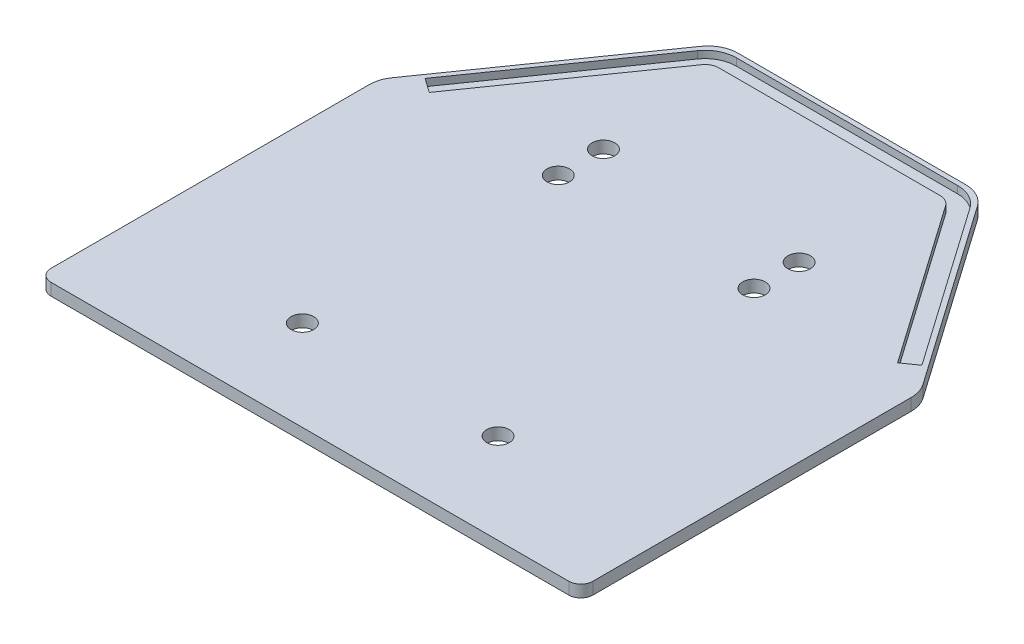
ISO-10303-21;
HEADER;
FILE_DESCRIPTION(('STEP AP214'),'2;1');
FILE_NAME('part.step','',(''),(''),'','','');
FILE_SCHEMA(('AUTOMOTIVE_DESIGN { 1 0 10303 214 1 1 1 1 }'));
ENDSEC;
DATA;
#1=APPLICATION_CONTEXT('core data for automotive mechanical design processes');
#2=APPLICATION_PROTOCOL_DEFINITION('international standard','automotive_design',2000,#1);
#3=PRODUCT_CONTEXT('',#1,'mechanical');
#4=PRODUCT('Part','Part','',(#3));
#5=PRODUCT_RELATED_PRODUCT_CATEGORY('part','',(#4));
#6=PRODUCT_DEFINITION_FORMATION('','',#4);
#7=PRODUCT_DEFINITION_CONTEXT('part definition',#1,'design');
#8=PRODUCT_DEFINITION('design','',#6,#7);
#9=PRODUCT_DEFINITION_SHAPE('','',#8);
#10=(LENGTH_UNIT() NAMED_UNIT(*) SI_UNIT(.MILLI.,.METRE.));
#11=(NAMED_UNIT(*) PLANE_ANGLE_UNIT() SI_UNIT($,.RADIAN.));
#12=(NAMED_UNIT(*) SI_UNIT($,.STERADIAN.) SOLID_ANGLE_UNIT());
#13=UNCERTAINTY_MEASURE_WITH_UNIT(LENGTH_MEASURE(1.E-05),#10,'distance_accuracy_value','');
#14=(GEOMETRIC_REPRESENTATION_CONTEXT(3) GLOBAL_UNCERTAINTY_ASSIGNED_CONTEXT((#13)) GLOBAL_UNIT_ASSIGNED_CONTEXT((#10,
#11,#12)) REPRESENTATION_CONTEXT('',''));
#15=CARTESIAN_POINT('',(0.,0.,0.));
#16=DIRECTION('',(0.,0.,1.));
#17=DIRECTION('',(1.,0.,0.));
#18=AXIS2_PLACEMENT_3D('',#15,#16,#17);
#19=CARTESIAN_POINT('',(0.,2.54,0.));
#20=DIRECTION('',(0.,-1.,0.));
#21=DIRECTION('',(0.,0.,-1.));
#22=AXIS2_PLACEMENT_3D('',#19,#20,#21);
#23=PLANE('',#22);
#24=CARTESIAN_POINT('',(-54.61,2.54,48.26));
#25=DIRECTION('',(0.,-1.,0.));
#26=DIRECTION('',(0.,0.,-1.));
#27=AXIS2_PLACEMENT_3D('',#24,#25,#26);
#28=CIRCLE('',#27,2.54);
#29=CARTESIAN_POINT('',(-57.15,2.54,48.26));
#30=VERTEX_POINT('',#29);
#31=CARTESIAN_POINT('',(-54.61,2.54,50.8));
#32=VERTEX_POINT('',#31);
#33=EDGE_CURVE('E336',#30,#32,#28,.F.);
#34=ORIENTED_EDGE('',*,*,#33,.T.);
#35=DIRECTION('',(1.,0.,0.));
#36=VECTOR('',#35,1.);
#37=CARTESIAN_POINT('',(-57.15,2.54,50.8));
#38=LINE('',#37,#36);
#39=CARTESIAN_POINT('',(54.61,2.54,50.8));
#40=VERTEX_POINT('',#39);
#41=EDGE_CURVE('E320',#32,#40,#38,.T.);
#42=ORIENTED_EDGE('',*,*,#41,.T.);
#43=CARTESIAN_POINT('',(54.61,2.54,48.26));
#44=DIRECTION('',(0.,-1.,0.));
#45=DIRECTION('',(0.,0.,-1.));
#46=AXIS2_PLACEMENT_3D('',#43,#44,#45);
#47=CIRCLE('',#46,2.54);
#48=CARTESIAN_POINT('',(57.15,2.54,48.26));
#49=VERTEX_POINT('',#48);
#50=EDGE_CURVE('E339',#40,#49,#47,.F.);
#51=ORIENTED_EDGE('',*,*,#50,.T.);
#52=DIRECTION('',(0.,0.,-1.));
#53=VECTOR('',#52,1.);
#54=CARTESIAN_POINT('',(57.15,2.54,50.8));
#55=LINE('',#54,#53);
#56=CARTESIAN_POINT('',(57.15,2.54,-18.8747754294001));
#57=VERTEX_POINT('',#56);
#58=EDGE_CURVE('E314',#49,#57,#55,.T.);
#59=ORIENTED_EDGE('',*,*,#58,.T.);
#60=CARTESIAN_POINT('',(50.8,2.54,-18.8747754294001));
#61=DIRECTION('',(0.,-1.,0.));
#62=DIRECTION('',(0.,0.,-1.));
#63=AXIS2_PLACEMENT_3D('',#60,#61,#62);
#64=CIRCLE('',#63,6.35);
#65=CARTESIAN_POINT('',(56.0016154812351,2.54,-22.5169858002293));
#66=VERTEX_POINT('',#65);
#67=EDGE_CURVE('E354',#57,#66,#64,.F.);
#68=ORIENTED_EDGE('',*,*,#67,.T.);
#69=DIRECTION('',(0.573576436351047,0.,0.819152044288991));
#70=VECTOR('',#69,1.);
#71=CARTESIAN_POINT('',(48.1571707167063,2.54,-33.7200139546897));
#72=LINE('',#71,#70);
#73=CARTESIAN_POINT('',(29.2010147102315,2.54,-60.7922103708292));
#74=VERTEX_POINT('',#73);
#75=EDGE_CURVE('E292',#74,#66,#72,.T.);
#76=ORIENTED_EDGE('',*,*,#75,.F.);
#77=CARTESIAN_POINT('',(23.9993992289964,2.54,-57.15));
#78=DIRECTION('',(0.,-1.,0.));
#79=DIRECTION('',(0.,0.,-1.));
#80=AXIS2_PLACEMENT_3D('',#77,#78,#79);
#81=CIRCLE('',#80,6.35);
#82=CARTESIAN_POINT('',(23.9993992289964,2.54,-63.5));
#83=VERTEX_POINT('',#82);
#84=EDGE_CURVE('E356',#74,#83,#81,.F.);
#85=ORIENTED_EDGE('',*,*,#84,.T.);
#86=DIRECTION('',(-1.,0.,0.));
#87=VECTOR('',#86,1.);
#88=CARTESIAN_POINT('',(0.,2.54,-63.5));
#89=LINE('',#88,#87);
#90=CARTESIAN_POINT('',(-23.9993992289964,2.54,-63.5));
#91=VERTEX_POINT('',#90);
#92=EDGE_CURVE('E279',#83,#91,#89,.T.);
#93=ORIENTED_EDGE('',*,*,#92,.T.);
#94=CARTESIAN_POINT('',(-23.9993992289964,2.54,-57.15));
#95=DIRECTION('',(0.,-1.,0.));
#96=DIRECTION('',(0.,0.,-1.));
#97=AXIS2_PLACEMENT_3D('',#94,#95,#96);
#98=CIRCLE('',#97,6.35);
#99=CARTESIAN_POINT('',(-29.2010147102315,2.54,-60.7922103708292));
#100=VERTEX_POINT('',#99);
#101=EDGE_CURVE('E358',#91,#100,#98,.F.);
#102=ORIENTED_EDGE('',*,*,#101,.T.);
#103=DIRECTION('',(-0.573576436351047,0.,0.819152044288992));
#104=VECTOR('',#103,1.);
#105=CARTESIAN_POINT('',(-48.1571707167063,2.54,-33.7200139546897));
#106=LINE('',#105,#104);
#107=CARTESIAN_POINT('',(-56.0016154812351,2.54,-22.5169858002292));
#108=VERTEX_POINT('',#107);
#109=EDGE_CURVE('E287',#100,#108,#106,.T.);
#110=ORIENTED_EDGE('',*,*,#109,.T.);
#111=CARTESIAN_POINT('',(-50.8,2.54,-18.8747754294001));
#112=DIRECTION('',(0.,-1.,0.));
#113=DIRECTION('',(0.,0.,-1.));
#114=AXIS2_PLACEMENT_3D('',#111,#112,#113);
#115=CIRCLE('',#114,6.35);
#116=CARTESIAN_POINT('',(-57.15,2.54,-18.8747754294001));
#117=VERTEX_POINT('',#116);
#118=EDGE_CURVE('E360',#108,#117,#115,.F.);
#119=ORIENTED_EDGE('',*,*,#118,.T.);
#120=DIRECTION('',(0.,0.,1.));
#121=VECTOR('',#120,1.);
#122=CARTESIAN_POINT('',(-57.15,2.54,50.8));
#123=LINE('',#122,#121);
#124=EDGE_CURVE('E317',#117,#30,#123,.T.);
#125=ORIENTED_EDGE('',*,*,#124,.T.);
#126=EDGE_LOOP('',(#34,#42,#51,#59,#68,#76,#85,#93,#102,#110,#119,#125));
#127=FACE_BOUND('',#126,.T.);
#128=DIRECTION('',(-1.,0.,0.));
#129=VECTOR('',#128,1.);
#130=CARTESIAN_POINT('',(23.3382790747957,2.54,-62.484));
#131=LINE('',#130,#129);
#132=CARTESIAN_POINT('',(23.3382790747957,2.54,-62.484));
#133=VERTEX_POINT('',#132);
#134=CARTESIAN_POINT('',(-23.3382790747956,2.54,-62.484));
#135=VERTEX_POINT('',#134);
#136=EDGE_CURVE('E588',#133,#135,#131,.T.);
#137=ORIENTED_EDGE('',*,*,#136,.F.);
#138=CARTESIAN_POINT('',(23.3382790747957,2.54,-55.88));
#139=DIRECTION('',(0.,1.,0.));
#140=DIRECTION('',(0.,0.,1.));
#141=AXIS2_PLACEMENT_3D('',#138,#139,#140);
#142=CIRCLE('',#141,6.604);
#143=CARTESIAN_POINT('',(28.7479591752803,2.54,-59.6678987856623));
#144=VERTEX_POINT('',#143);
#145=EDGE_CURVE('E214',#144,#133,#142,.T.);
#146=ORIENTED_EDGE('',*,*,#145,.F.);
#147=DIRECTION('',(-0.573576436351047,0.,-0.819152044288991));
#148=VECTOR('',#147,1.);
#149=CARTESIAN_POINT('',(52.4003885069718,2.54,-25.8887289809984));
#150=LINE('',#149,#148);
#151=CARTESIAN_POINT('',(52.4003885069718,2.54,-25.8887289809984));
#152=VERTEX_POINT('',#151);
#153=EDGE_CURVE('E227',#152,#144,#150,.T.);
#154=ORIENTED_EDGE('',*,*,#153,.F.);
#155=DIRECTION('',(0.819152044288991,0.,-0.573576436351047));
#156=VECTOR('',#155,1.);
#157=CARTESIAN_POINT('',(49.3834515278555,2.54,-23.7762469659175));
#158=LINE('',#157,#156);
#159=CARTESIAN_POINT('',(49.3834515278555,2.54,-23.7762469659175));
#160=VERTEX_POINT('',#159);
#161=EDGE_CURVE('E221',#160,#152,#158,.T.);
#162=ORIENTED_EDGE('',*,*,#161,.F.);
#163=DIRECTION('',(0.573576436351047,0.,0.819152044288991));
#164=VECTOR('',#163,1.);
#165=CARTESIAN_POINT('',(25.7310221961639,2.54,-57.5554167705814));
#166=LINE('',#165,#164);
#167=CARTESIAN_POINT('',(25.7310221961639,2.54,-57.5554167705814));
#168=VERTEX_POINT('',#167);
#169=EDGE_CURVE('E223',#168,#160,#166,.T.);
#170=ORIENTED_EDGE('',*,*,#169,.F.);
#171=CARTESIAN_POINT('',(23.3382790747957,2.54,-55.88));
#172=DIRECTION('',(0.,1.,0.));
#173=DIRECTION('',(0.,0.,1.));
#174=AXIS2_PLACEMENT_3D('',#171,#172,#173);
#175=CIRCLE('',#174,2.92100000000001);
#176=CARTESIAN_POINT('',(23.3382790747957,2.54,-58.801));
#177=VERTEX_POINT('',#176);
#178=EDGE_CURVE('E238',#168,#177,#175,.T.);
#179=ORIENTED_EDGE('',*,*,#178,.T.);
#180=DIRECTION('',(1.,0.,0.));
#181=VECTOR('',#180,1.);
#182=CARTESIAN_POINT('',(-23.3382790747956,2.54,-58.801));
#183=LINE('',#182,#181);
#184=CARTESIAN_POINT('',(-23.3382790747956,2.54,-58.801));
#185=VERTEX_POINT('',#184);
#186=EDGE_CURVE('E569',#185,#177,#183,.T.);
#187=ORIENTED_EDGE('',*,*,#186,.F.);
#188=CARTESIAN_POINT('',(-23.3382790747957,2.54,-55.88));
#189=DIRECTION('',(0.,1.,0.));
#190=DIRECTION('',(0.,0.,1.));
#191=AXIS2_PLACEMENT_3D('',#188,#189,#190);
#192=CIRCLE('',#191,2.92100000000001);
#193=CARTESIAN_POINT('',(-25.7310221961638,2.54,-57.5554167705814));
#194=VERTEX_POINT('',#193);
#195=EDGE_CURVE('E247',#185,#194,#192,.T.);
#196=ORIENTED_EDGE('',*,*,#195,.T.);
#197=DIRECTION('',(0.573576436351047,0.,-0.819152044288991));
#198=VECTOR('',#197,1.);
#199=CARTESIAN_POINT('',(-49.3834515278554,2.54,-23.7762469659175));
#200=LINE('',#199,#198);
#201=CARTESIAN_POINT('',(-49.3834515278554,2.54,-23.7762469659175));
#202=VERTEX_POINT('',#201);
#203=EDGE_CURVE('E574',#202,#194,#200,.T.);
#204=ORIENTED_EDGE('',*,*,#203,.F.);
#205=DIRECTION('',(0.819152044288991,0.,0.573576436351047));
#206=VECTOR('',#205,1.);
#207=CARTESIAN_POINT('',(-52.4003885069717,2.54,-25.8887289809984));
#208=LINE('',#207,#206);
#209=CARTESIAN_POINT('',(-52.4003885069717,2.54,-25.8887289809984));
#210=VERTEX_POINT('',#209);
#211=EDGE_CURVE('E579',#210,#202,#208,.T.);
#212=ORIENTED_EDGE('',*,*,#211,.F.);
#213=DIRECTION('',(-0.573576436351047,0.,0.819152044288991));
#214=VECTOR('',#213,1.);
#215=CARTESIAN_POINT('',(-28.7479591752802,2.54,-59.6678987856623));
#216=LINE('',#215,#214);
#217=CARTESIAN_POINT('',(-28.7479591752802,2.54,-59.6678987856623));
#218=VERTEX_POINT('',#217);
#219=EDGE_CURVE('E582',#218,#210,#216,.T.);
#220=ORIENTED_EDGE('',*,*,#219,.F.);
#221=CARTESIAN_POINT('',(-23.3382790747957,2.54,-55.88));
#222=DIRECTION('',(0.,1.,0.));
#223=DIRECTION('',(0.,0.,1.));
#224=AXIS2_PLACEMENT_3D('',#221,#222,#223);
#225=CIRCLE('',#224,6.604);
#226=EDGE_CURVE('E585',#135,#218,#225,.T.);
#227=ORIENTED_EDGE('',*,*,#226,.F.);
#228=EDGE_LOOP('',(#137,#146,#154,#162,#170,#179,#187,#196,#204,#212,#220,#227));
#229=FACE_BOUND('',#228,.T.);
#230=CARTESIAN_POINT('',(20.6375,2.54,31.75));
#231=DIRECTION('',(0.,-1.,0.));
#232=DIRECTION('',(0.,0.,-1.));
#233=AXIS2_PLACEMENT_3D('',#230,#231,#232);
#234=CIRCLE('',#233,2.38125);
#235=CARTESIAN_POINT('',(20.6375,2.54,29.36875));
#236=VERTEX_POINT('',#235);
#237=EDGE_CURVE('E242',#236,#236,#234,.T.);
#238=ORIENTED_EDGE('',*,*,#237,.T.);
#239=EDGE_LOOP('',(#238));
#240=FACE_BOUND('',#239,.T.);
#241=CARTESIAN_POINT('',(-20.6375,2.54,31.75));
#242=DIRECTION('',(0.,-1.,0.));
#243=DIRECTION('',(0.,0.,-1.));
#244=AXIS2_PLACEMENT_3D('',#241,#242,#243);
#245=CIRCLE('',#244,2.38125);
#246=CARTESIAN_POINT('',(-20.6375,2.54,29.36875));
#247=VERTEX_POINT('',#246);
#248=EDGE_CURVE('E617',#247,#247,#245,.T.);
#249=ORIENTED_EDGE('',*,*,#248,.T.);
#250=EDGE_LOOP('',(#249));
#251=FACE_BOUND('',#250,.T.);
#252=CARTESIAN_POINT('',(20.6375,2.54,-22.225));
#253=DIRECTION('',(0.,-1.,0.));
#254=DIRECTION('',(0.,0.,-1.));
#255=AXIS2_PLACEMENT_3D('',#252,#253,#254);
#256=CIRCLE('',#255,2.38125);
#257=CARTESIAN_POINT('',(20.6375,2.54,-24.60625));
#258=VERTEX_POINT('',#257);
#259=EDGE_CURVE('E555',#258,#258,#256,.T.);
#260=ORIENTED_EDGE('',*,*,#259,.T.);
#261=EDGE_LOOP('',(#260));
#262=FACE_BOUND('',#261,.T.);
#263=CARTESIAN_POINT('',(20.6375,2.54,-31.75));
#264=DIRECTION('',(0.,-1.,0.));
#265=DIRECTION('',(0.,0.,-1.));
#266=AXIS2_PLACEMENT_3D('',#263,#264,#265);
#267=CIRCLE('',#266,2.38125);
#268=CARTESIAN_POINT('',(20.6375,2.54,-34.13125));
#269=VERTEX_POINT('',#268);
#270=EDGE_CURVE('E537',#269,#269,#267,.T.);
#271=ORIENTED_EDGE('',*,*,#270,.T.);
#272=EDGE_LOOP('',(#271));
#273=FACE_BOUND('',#272,.T.);
#274=CARTESIAN_POINT('',(-20.6375,2.54,-22.225));
#275=DIRECTION('',(0.,-1.,0.));
#276=DIRECTION('',(0.,0.,-1.));
#277=AXIS2_PLACEMENT_3D('',#274,#275,#276);
#278=CIRCLE('',#277,2.38125);
#279=CARTESIAN_POINT('',(-20.6375,2.54,-24.60625));
#280=VERTEX_POINT('',#279);
#281=EDGE_CURVE('E561',#280,#280,#278,.T.);
#282=ORIENTED_EDGE('',*,*,#281,.T.);
#283=EDGE_LOOP('',(#282));
#284=FACE_BOUND('',#283,.T.);
#285=CARTESIAN_POINT('',(-20.6375,2.54,-31.75));
#286=DIRECTION('',(0.,-1.,0.));
#287=DIRECTION('',(0.,0.,-1.));
#288=AXIS2_PLACEMENT_3D('',#285,#286,#287);
#289=CIRCLE('',#288,2.38125);
#290=CARTESIAN_POINT('',(-20.6375,2.54,-34.13125));
#291=VERTEX_POINT('',#290);
#292=EDGE_CURVE('E556',#291,#291,#289,.T.);
#293=ORIENTED_EDGE('',*,*,#292,.T.);
#294=EDGE_LOOP('',(#293));
#295=FACE_BOUND('',#294,.T.);
#296=ADVANCED_FACE('F35',(#127,#229,#240,#251,#262,#273,#284,#295),#23,.F.);
#297=CARTESIAN_POINT('',(57.15,2.54,50.8));
#298=DIRECTION('',(-1.,0.,0.));
#299=DIRECTION('',(0.,0.,1.));
#300=AXIS2_PLACEMENT_3D('',#297,#298,#299);
#301=PLANE('',#300);
#302=DIRECTION('',(0.,0.,-1.));
#303=VECTOR('',#302,1.);
#304=CARTESIAN_POINT('',(57.15,0.,50.8));
#305=LINE('',#304,#303);
#306=CARTESIAN_POINT('',(57.15,0.,48.26));
#307=VERTEX_POINT('',#306);
#308=CARTESIAN_POINT('',(57.15,0.,-18.8747754294001));
#309=VERTEX_POINT('',#308);
#310=EDGE_CURVE('E313',#307,#309,#305,.T.);
#311=ORIENTED_EDGE('',*,*,#310,.T.);
#312=DIRECTION('',(0.,1.,0.));
#313=VECTOR('',#312,1.);
#314=CARTESIAN_POINT('',(57.15,2.54,-18.8747754294001));
#315=LINE('',#314,#313);
#316=EDGE_CURVE('E11',#309,#57,#315,.T.);
#317=ORIENTED_EDGE('',*,*,#316,.T.);
#318=ORIENTED_EDGE('',*,*,#58,.F.);
#319=DIRECTION('',(0.,-1.,0.));
#320=VECTOR('',#319,1.);
#321=CARTESIAN_POINT('',(57.15,2.54,48.26));
#322=LINE('',#321,#320);
#323=EDGE_CURVE('E333',#49,#307,#322,.T.);
#324=ORIENTED_EDGE('',*,*,#323,.T.);
#325=EDGE_LOOP('',(#311,#317,#318,#324));
#326=FACE_BOUND('',#325,.T.);
#327=ADVANCED_FACE('F390',(#326),#301,.F.);
#328=CARTESIAN_POINT('',(0.,0.,0.));
#329=DIRECTION('',(0.,-1.,0.));
#330=DIRECTION('',(0.,0.,-1.));
#331=AXIS2_PLACEMENT_3D('',#328,#329,#330);
#332=PLANE('',#331);
#333=CARTESIAN_POINT('',(20.6375,0.,-31.75));
#334=DIRECTION('',(0.,1.,0.));
#335=DIRECTION('',(0.,0.,1.));
#336=AXIS2_PLACEMENT_3D('',#333,#334,#335);
#337=CIRCLE('',#336,2.38125);
#338=CARTESIAN_POINT('',(20.6375,0.,-29.36875));
#339=VERTEX_POINT('',#338);
#340=EDGE_CURVE('E295',#339,#339,#337,.T.);
#341=ORIENTED_EDGE('',*,*,#340,.T.);
#342=EDGE_LOOP('',(#341));
#343=FACE_BOUND('',#342,.T.);
#344=CARTESIAN_POINT('',(-20.6375,0.,-22.225));
#345=DIRECTION('',(0.,1.,0.));
#346=DIRECTION('',(0.,0.,1.));
#347=AXIS2_PLACEMENT_3D('',#344,#345,#346);
#348=CIRCLE('',#347,2.38125);
#349=CARTESIAN_POINT('',(-20.6375,0.,-19.84375));
#350=VERTEX_POINT('',#349);
#351=EDGE_CURVE('E303',#350,#350,#348,.T.);
#352=ORIENTED_EDGE('',*,*,#351,.T.);
#353=EDGE_LOOP('',(#352));
#354=FACE_BOUND('',#353,.T.);
#355=CARTESIAN_POINT('',(20.6375,0.,31.75));
#356=DIRECTION('',(0.,1.,0.));
#357=DIRECTION('',(0.,0.,1.));
#358=AXIS2_PLACEMENT_3D('',#355,#356,#357);
#359=CIRCLE('',#358,2.38125);
#360=CARTESIAN_POINT('',(20.6375,0.,34.13125));
#361=VERTEX_POINT('',#360);
#362=EDGE_CURVE('E299',#361,#361,#359,.T.);
#363=ORIENTED_EDGE('',*,*,#362,.T.);
#364=EDGE_LOOP('',(#363));
#365=FACE_BOUND('',#364,.T.);
#366=CARTESIAN_POINT('',(-20.6375,0.,31.75));
#367=DIRECTION('',(0.,1.,0.));
#368=DIRECTION('',(0.,0.,1.));
#369=AXIS2_PLACEMENT_3D('',#366,#367,#368);
#370=CIRCLE('',#369,2.38125);
#371=CARTESIAN_POINT('',(-20.6375,0.,34.13125));
#372=VERTEX_POINT('',#371);
#373=EDGE_CURVE('E296',#372,#372,#370,.T.);
#374=ORIENTED_EDGE('',*,*,#373,.T.);
#375=EDGE_LOOP('',(#374));
#376=FACE_BOUND('',#375,.T.);
#377=CARTESIAN_POINT('',(20.6375,0.,-22.225));
#378=DIRECTION('',(0.,1.,0.));
#379=DIRECTION('',(0.,0.,1.));
#380=AXIS2_PLACEMENT_3D('',#377,#378,#379);
#381=CIRCLE('',#380,2.38125);
#382=CARTESIAN_POINT('',(20.6375,0.,-19.84375));
#383=VERTEX_POINT('',#382);
#384=EDGE_CURVE('E300',#383,#383,#381,.T.);
#385=ORIENTED_EDGE('',*,*,#384,.T.);
#386=EDGE_LOOP('',(#385));
#387=FACE_BOUND('',#386,.T.);
#388=CARTESIAN_POINT('',(-20.6375,0.,-31.75));
#389=DIRECTION('',(0.,1.,0.));
#390=DIRECTION('',(0.,0.,1.));
#391=AXIS2_PLACEMENT_3D('',#388,#389,#390);
#392=CIRCLE('',#391,2.38125);
#393=CARTESIAN_POINT('',(-20.6375,0.,-29.36875));
#394=VERTEX_POINT('',#393);
#395=EDGE_CURVE('E306',#394,#394,#392,.T.);
#396=ORIENTED_EDGE('',*,*,#395,.T.);
#397=EDGE_LOOP('',(#396));
#398=FACE_BOUND('',#397,.T.);
#399=DIRECTION('',(0.,0.,1.));
#400=VECTOR('',#399,1.);
#401=CARTESIAN_POINT('',(-57.15,0.,50.8));
#402=LINE('',#401,#400);
#403=CARTESIAN_POINT('',(-57.15,0.,-18.8747754294001));
#404=VERTEX_POINT('',#403);
#405=CARTESIAN_POINT('',(-57.15,0.,48.26));
#406=VERTEX_POINT('',#405);
#407=EDGE_CURVE('E325',#404,#406,#402,.T.);
#408=ORIENTED_EDGE('',*,*,#407,.F.);
#409=CARTESIAN_POINT('',(-50.8,0.,-18.8747754294001));
#410=DIRECTION('',(0.,-1.,0.));
#411=DIRECTION('',(0.,0.,-1.));
#412=AXIS2_PLACEMENT_3D('',#409,#410,#411);
#413=CIRCLE('',#412,6.35);
#414=CARTESIAN_POINT('',(-56.0016154812351,0.,-22.5169858002292));
#415=VERTEX_POINT('',#414);
#416=EDGE_CURVE('E368',#404,#415,#413,.T.);
#417=ORIENTED_EDGE('',*,*,#416,.T.);
#418=DIRECTION('',(0.573576436351046,0.,-0.819152044288991));
#419=VECTOR('',#418,1.);
#420=CARTESIAN_POINT('',(-48.1571707167063,0.,-33.7200139546897));
#421=LINE('',#420,#419);
#422=CARTESIAN_POINT('',(-29.2010147102315,0.,-60.7922103708291));
#423=VERTEX_POINT('',#422);
#424=EDGE_CURVE('E282',#415,#423,#421,.T.);
#425=ORIENTED_EDGE('',*,*,#424,.T.);
#426=CARTESIAN_POINT('',(-23.9993992289964,0.,-57.15));
#427=DIRECTION('',(0.,-1.,0.));
#428=DIRECTION('',(0.,0.,-1.));
#429=AXIS2_PLACEMENT_3D('',#426,#427,#428);
#430=CIRCLE('',#429,6.35);
#431=CARTESIAN_POINT('',(-23.9993992289964,0.,-63.5));
#432=VERTEX_POINT('',#431);
#433=EDGE_CURVE('E366',#423,#432,#430,.T.);
#434=ORIENTED_EDGE('',*,*,#433,.T.);
#435=DIRECTION('',(-1.,0.,0.));
#436=VECTOR('',#435,1.);
#437=CARTESIAN_POINT('',(0.,0.,-63.5));
#438=LINE('',#437,#436);
#439=CARTESIAN_POINT('',(23.9993992289964,0.,-63.5));
#440=VERTEX_POINT('',#439);
#441=EDGE_CURVE('E278',#440,#432,#438,.T.);
#442=ORIENTED_EDGE('',*,*,#441,.F.);
#443=CARTESIAN_POINT('',(23.9993992289964,0.,-57.15));
#444=DIRECTION('',(0.,-1.,0.));
#445=DIRECTION('',(0.,0.,-1.));
#446=AXIS2_PLACEMENT_3D('',#443,#444,#445);
#447=CIRCLE('',#446,6.35);
#448=CARTESIAN_POINT('',(29.2010147102315,0.,-60.7922103708292));
#449=VERTEX_POINT('',#448);
#450=EDGE_CURVE('E56',#440,#449,#447,.T.);
#451=ORIENTED_EDGE('',*,*,#450,.T.);
#452=DIRECTION('',(-0.573576436351047,0.,-0.819152044288991));
#453=VECTOR('',#452,1.);
#454=CARTESIAN_POINT('',(48.1571707167063,0.,-33.7200139546897));
#455=LINE('',#454,#453);
#456=CARTESIAN_POINT('',(56.0016154812351,0.,-22.5169858002293));
#457=VERTEX_POINT('',#456);
#458=EDGE_CURVE('E285',#457,#449,#455,.T.);
#459=ORIENTED_EDGE('',*,*,#458,.F.);
#460=CARTESIAN_POINT('',(50.8,0.,-18.8747754294001));
#461=DIRECTION('',(0.,-1.,0.));
#462=DIRECTION('',(0.,0.,-1.));
#463=AXIS2_PLACEMENT_3D('',#460,#461,#462);
#464=CIRCLE('',#463,6.35);
#465=EDGE_CURVE('E50',#457,#309,#464,.T.);
#466=ORIENTED_EDGE('',*,*,#465,.T.);
#467=ORIENTED_EDGE('',*,*,#310,.F.);
#468=CARTESIAN_POINT('',(54.61,0.,48.26));
#469=DIRECTION('',(0.,-1.,0.));
#470=DIRECTION('',(0.,0.,-1.));
#471=AXIS2_PLACEMENT_3D('',#468,#469,#470);
#472=CIRCLE('',#471,2.54);
#473=CARTESIAN_POINT('',(54.61,0.,50.8));
#474=VERTEX_POINT('',#473);
#475=EDGE_CURVE('E331',#307,#474,#472,.T.);
#476=ORIENTED_EDGE('',*,*,#475,.T.);
#477=DIRECTION('',(1.,0.,0.));
#478=VECTOR('',#477,1.);
#479=CARTESIAN_POINT('',(-57.15,0.,50.8));
#480=LINE('',#479,#478);
#481=CARTESIAN_POINT('',(-54.61,0.,50.8));
#482=VERTEX_POINT('',#481);
#483=EDGE_CURVE('E318',#482,#474,#480,.T.);
#484=ORIENTED_EDGE('',*,*,#483,.F.);
#485=CARTESIAN_POINT('',(-54.61,0.,48.26));
#486=DIRECTION('',(0.,-1.,0.));
#487=DIRECTION('',(0.,0.,-1.));
#488=AXIS2_PLACEMENT_3D('',#485,#486,#487);
#489=CIRCLE('',#488,2.54);
#490=EDGE_CURVE('E323',#482,#406,#489,.T.);
#491=ORIENTED_EDGE('',*,*,#490,.T.);
#492=EDGE_LOOP('',(#408,#417,#425,#434,#442,#451,#459,#466,#467,#476,#484,#491));
#493=FACE_BOUND('',#492,.T.);
#494=ADVANCED_FACE('F393',(#343,#354,#365,#376,#387,#398,#493),#332,.T.);
#495=CARTESIAN_POINT('',(-57.15,2.54,50.8));
#496=DIRECTION('',(1.,0.,0.));
#497=DIRECTION('',(0.,0.,-1.));
#498=AXIS2_PLACEMENT_3D('',#495,#496,#497);
#499=PLANE('',#498);
#500=ORIENTED_EDGE('',*,*,#124,.F.);
#501=DIRECTION('',(0.,1.,0.));
#502=VECTOR('',#501,1.);
#503=CARTESIAN_POINT('',(-57.15,2.54,-18.8747754294001));
#504=LINE('',#503,#502);
#505=EDGE_CURVE('E362',#117,#404,#504,.F.);
#506=ORIENTED_EDGE('',*,*,#505,.T.);
#507=ORIENTED_EDGE('',*,*,#407,.T.);
#508=DIRECTION('',(0.,-1.,0.));
#509=VECTOR('',#508,1.);
#510=CARTESIAN_POINT('',(-57.15,2.54,48.26));
#511=LINE('',#510,#509);
#512=EDGE_CURVE('E346',#406,#30,#511,.F.);
#513=ORIENTED_EDGE('',*,*,#512,.T.);
#514=EDGE_LOOP('',(#500,#506,#507,#513));
#515=FACE_BOUND('',#514,.T.);
#516=ADVANCED_FACE('F444',(#515),#499,.F.);
#517=CARTESIAN_POINT('',(-57.15,2.54,50.8));
#518=DIRECTION('',(0.,0.,-1.));
#519=DIRECTION('',(-1.,0.,0.));
#520=AXIS2_PLACEMENT_3D('',#517,#518,#519);
#521=PLANE('',#520);
#522=ORIENTED_EDGE('',*,*,#41,.F.);
#523=DIRECTION('',(0.,-1.,0.));
#524=VECTOR('',#523,1.);
#525=CARTESIAN_POINT('',(-54.61,2.54,50.8));
#526=LINE('',#525,#524);
#527=EDGE_CURVE('E341',#32,#482,#526,.T.);
#528=ORIENTED_EDGE('',*,*,#527,.T.);
#529=ORIENTED_EDGE('',*,*,#483,.T.);
#530=DIRECTION('',(0.,-1.,0.));
#531=VECTOR('',#530,1.);
#532=CARTESIAN_POINT('',(54.61,2.54,50.8));
#533=LINE('',#532,#531);
#534=EDGE_CURVE('E344',#474,#40,#533,.F.);
#535=ORIENTED_EDGE('',*,*,#534,.T.);
#536=EDGE_LOOP('',(#522,#528,#529,#535));
#537=FACE_BOUND('',#536,.T.);
#538=ADVANCED_FACE('F398',(#537),#521,.F.);
#539=CARTESIAN_POINT('',(20.6375,5.08,31.75));
#540=DIRECTION('',(0.,-1.,0.));
#541=DIRECTION('',(0.,0.,-1.));
#542=AXIS2_PLACEMENT_3D('',#539,#540,#541);
#543=CYLINDRICAL_SURFACE('',#542,2.38125);
#544=ORIENTED_EDGE('',*,*,#237,.F.);
#545=EDGE_LOOP('',(#544));
#546=FACE_BOUND('',#545,.T.);
#547=ORIENTED_EDGE('',*,*,#362,.F.);
#548=EDGE_LOOP('',(#547));
#549=FACE_BOUND('',#548,.T.);
#550=ADVANCED_FACE('F448',(#546,#549),#543,.F.);
#551=CARTESIAN_POINT('',(20.6375,5.08,-22.225));
#552=DIRECTION('',(0.,-1.,0.));
#553=DIRECTION('',(0.,0.,-1.));
#554=AXIS2_PLACEMENT_3D('',#551,#552,#553);
#555=CYLINDRICAL_SURFACE('',#554,2.38125);
#556=ORIENTED_EDGE('',*,*,#259,.F.);
#557=EDGE_LOOP('',(#556));
#558=FACE_BOUND('',#557,.T.);
#559=ORIENTED_EDGE('',*,*,#384,.F.);
#560=EDGE_LOOP('',(#559));
#561=FACE_BOUND('',#560,.T.);
#562=ADVANCED_FACE('F518',(#558,#561),#555,.F.);
#563=CARTESIAN_POINT('',(20.6375,5.08,-31.75));
#564=DIRECTION('',(0.,-1.,0.));
#565=DIRECTION('',(0.,0.,-1.));
#566=AXIS2_PLACEMENT_3D('',#563,#564,#565);
#567=CYLINDRICAL_SURFACE('',#566,2.38125);
#568=ORIENTED_EDGE('',*,*,#270,.F.);
#569=EDGE_LOOP('',(#568));
#570=FACE_BOUND('',#569,.T.);
#571=ORIENTED_EDGE('',*,*,#340,.F.);
#572=EDGE_LOOP('',(#571));
#573=FACE_BOUND('',#572,.T.);
#574=ADVANCED_FACE('F521',(#570,#573),#567,.F.);
#575=CARTESIAN_POINT('',(-20.6375,5.08,-31.75));
#576=DIRECTION('',(0.,-1.,0.));
#577=DIRECTION('',(0.,0.,-1.));
#578=AXIS2_PLACEMENT_3D('',#575,#576,#577);
#579=CYLINDRICAL_SURFACE('',#578,2.38125);
#580=ORIENTED_EDGE('',*,*,#292,.F.);
#581=EDGE_LOOP('',(#580));
#582=FACE_BOUND('',#581,.T.);
#583=ORIENTED_EDGE('',*,*,#395,.F.);
#584=EDGE_LOOP('',(#583));
#585=FACE_BOUND('',#584,.T.);
#586=ADVANCED_FACE('F440',(#582,#585),#579,.F.);
#587=CARTESIAN_POINT('',(-20.6375,5.08,-22.225));
#588=DIRECTION('',(0.,-1.,0.));
#589=DIRECTION('',(0.,0.,-1.));
#590=AXIS2_PLACEMENT_3D('',#587,#588,#589);
#591=CYLINDRICAL_SURFACE('',#590,2.38125);
#592=ORIENTED_EDGE('',*,*,#281,.F.);
#593=EDGE_LOOP('',(#592));
#594=FACE_BOUND('',#593,.T.);
#595=ORIENTED_EDGE('',*,*,#351,.F.);
#596=EDGE_LOOP('',(#595));
#597=FACE_BOUND('',#596,.T.);
#598=ADVANCED_FACE('F516',(#594,#597),#591,.F.);
#599=CARTESIAN_POINT('',(-20.6375,5.08,31.75));
#600=DIRECTION('',(0.,-1.,0.));
#601=DIRECTION('',(0.,0.,-1.));
#602=AXIS2_PLACEMENT_3D('',#599,#600,#601);
#603=CYLINDRICAL_SURFACE('',#602,2.38125);
#604=ORIENTED_EDGE('',*,*,#248,.F.);
#605=EDGE_LOOP('',(#604));
#606=FACE_BOUND('',#605,.T.);
#607=ORIENTED_EDGE('',*,*,#373,.F.);
#608=EDGE_LOOP('',(#607));
#609=FACE_BOUND('',#608,.T.);
#610=ADVANCED_FACE('F453',(#606,#609),#603,.F.);
#611=CARTESIAN_POINT('',(54.61,2.54,48.26));
#612=DIRECTION('',(0.,-1.,0.));
#613=DIRECTION('',(0.,0.,-1.));
#614=AXIS2_PLACEMENT_3D('',#611,#612,#613);
#615=CYLINDRICAL_SURFACE('',#614,2.54);
#616=ORIENTED_EDGE('',*,*,#50,.F.);
#617=ORIENTED_EDGE('',*,*,#534,.F.);
#618=ORIENTED_EDGE('',*,*,#475,.F.);
#619=ORIENTED_EDGE('',*,*,#323,.F.);
#620=EDGE_LOOP('',(#616,#617,#618,#619));
#621=FACE_BOUND('',#620,.T.);
#622=ADVANCED_FACE('F401',(#621),#615,.T.);
#623=CARTESIAN_POINT('',(-54.61,2.54,48.26));
#624=DIRECTION('',(0.,-1.,0.));
#625=DIRECTION('',(0.,0.,-1.));
#626=AXIS2_PLACEMENT_3D('',#623,#624,#625);
#627=CYLINDRICAL_SURFACE('',#626,2.54);
#628=ORIENTED_EDGE('',*,*,#33,.F.);
#629=ORIENTED_EDGE('',*,*,#512,.F.);
#630=ORIENTED_EDGE('',*,*,#490,.F.);
#631=ORIENTED_EDGE('',*,*,#527,.F.);
#632=EDGE_LOOP('',(#628,#629,#630,#631));
#633=FACE_BOUND('',#632,.T.);
#634=ADVANCED_FACE('F406',(#633),#627,.T.);
#635=CARTESIAN_POINT('',(-48.1571707167063,0.,-33.7200139546897));
#636=DIRECTION('',(0.819152044288992,0.,0.573576436351047));
#637=DIRECTION('',(0.573576436351047,0.,-0.819152044288992));
#638=AXIS2_PLACEMENT_3D('',#635,#636,#637);
#639=PLANE('',#638);
#640=ORIENTED_EDGE('',*,*,#424,.F.);
#641=DIRECTION('',(0.,1.,0.));
#642=VECTOR('',#641,1.);
#643=CARTESIAN_POINT('',(-56.0016154812351,0.,-22.5169858002292));
#644=LINE('',#643,#642);
#645=EDGE_CURVE('E351',#415,#108,#644,.T.);
#646=ORIENTED_EDGE('',*,*,#645,.T.);
#647=ORIENTED_EDGE('',*,*,#109,.F.);
#648=DIRECTION('',(0.,1.,0.));
#649=VECTOR('',#648,1.);
#650=CARTESIAN_POINT('',(-29.2010147102315,0.,-60.7922103708292));
#651=LINE('',#650,#649);
#652=EDGE_CURVE('E349',#100,#423,#651,.F.);
#653=ORIENTED_EDGE('',*,*,#652,.T.);
#654=EDGE_LOOP('',(#640,#646,#647,#653));
#655=FACE_BOUND('',#654,.T.);
#656=ADVANCED_FACE('F416',(#655),#639,.F.);
#657=CARTESIAN_POINT('',(48.1571707167063,0.,-33.7200139546897));
#658=DIRECTION('',(0.819152044288991,0.,-0.573576436351047));
#659=DIRECTION('',(-0.573576436351047,0.,-0.819152044288991));
#660=AXIS2_PLACEMENT_3D('',#657,#658,#659);
#661=PLANE('',#660);
#662=ORIENTED_EDGE('',*,*,#458,.T.);
#663=DIRECTION('',(0.,1.,0.));
#664=VECTOR('',#663,1.);
#665=CARTESIAN_POINT('',(29.2010147102315,0.,-60.7922103708292));
#666=LINE('',#665,#664);
#667=EDGE_CURVE('E43',#449,#74,#666,.T.);
#668=ORIENTED_EDGE('',*,*,#667,.T.);
#669=ORIENTED_EDGE('',*,*,#75,.T.);
#670=DIRECTION('',(0.,1.,0.));
#671=VECTOR('',#670,1.);
#672=CARTESIAN_POINT('',(56.0016154812351,0.,-22.5169858002293));
#673=LINE('',#672,#671);
#674=EDGE_CURVE('E375',#66,#457,#673,.F.);
#675=ORIENTED_EDGE('',*,*,#674,.T.);
#676=EDGE_LOOP('',(#662,#668,#669,#675));
#677=FACE_BOUND('',#676,.T.);
#678=ADVANCED_FACE('F380',(#677),#661,.T.);
#679=CARTESIAN_POINT('',(0.,-73.5007845624198,-63.5));
#680=DIRECTION('',(0.,0.,-1.));
#681=DIRECTION('',(-1.,0.,0.));
#682=AXIS2_PLACEMENT_3D('',#679,#680,#681);
#683=PLANE('',#682);
#684=ORIENTED_EDGE('',*,*,#441,.T.);
#685=DIRECTION('',(0.,1.,0.));
#686=VECTOR('',#685,1.);
#687=CARTESIAN_POINT('',(-23.9993992289964,2.53999999999997,-63.5));
#688=LINE('',#687,#686);
#689=EDGE_CURVE('E372',#432,#91,#688,.T.);
#690=ORIENTED_EDGE('',*,*,#689,.T.);
#691=ORIENTED_EDGE('',*,*,#92,.F.);
#692=DIRECTION('',(0.,1.,0.));
#693=VECTOR('',#692,1.);
#694=CARTESIAN_POINT('',(23.9993992289964,-73.5007845624198,-63.5));
#695=LINE('',#694,#693);
#696=EDGE_CURVE('E370',#83,#440,#695,.F.);
#697=ORIENTED_EDGE('',*,*,#696,.T.);
#698=EDGE_LOOP('',(#684,#690,#691,#697));
#699=FACE_BOUND('',#698,.T.);
#700=ADVANCED_FACE('F423',(#699),#683,.T.);
#701=CARTESIAN_POINT('',(0.,1.01404194306202,0.));
#702=DIRECTION('',(0.,-1.,0.));
#703=DIRECTION('',(0.,0.,-1.));
#704=AXIS2_PLACEMENT_3D('',#701,#702,#703);
#705=PLANE('',#704);
#706=DIRECTION('',(-0.573576436351047,0.,-0.819152044288991));
#707=VECTOR('',#706,1.);
#708=CARTESIAN_POINT('',(52.4003885069718,1.01404194306202,-25.8887289809984));
#709=LINE('',#708,#707);
#710=CARTESIAN_POINT('',(52.4003885069718,1.01404194306204,-25.8887289809984));
#711=VERTEX_POINT('',#710);
#712=CARTESIAN_POINT('',(28.7479591752803,1.01404194306203,-59.6678987856623));
#713=VERTEX_POINT('',#712);
#714=EDGE_CURVE('E219',#711,#713,#709,.T.);
#715=ORIENTED_EDGE('',*,*,#714,.T.);
#716=CARTESIAN_POINT('',(23.3382790747957,1.01404194306202,-55.88));
#717=DIRECTION('',(0.,-1.,0.));
#718=DIRECTION('',(1.,0.,0.));
#719=AXIS2_PLACEMENT_3D('',#716,#717,#718);
#720=CIRCLE('',#719,6.604);
#721=CARTESIAN_POINT('',(23.3382790747957,1.01404194306202,-62.484));
#722=VERTEX_POINT('',#721);
#723=EDGE_CURVE('E211',#713,#722,#720,.F.);
#724=ORIENTED_EDGE('',*,*,#723,.T.);
#725=DIRECTION('',(-1.,0.,0.));
#726=VECTOR('',#725,1.);
#727=CARTESIAN_POINT('',(23.3382790747957,1.01404194306202,-62.484));
#728=LINE('',#727,#726);
#729=CARTESIAN_POINT('',(-23.3382790747956,1.01404194306202,-62.484));
#730=VERTEX_POINT('',#729);
#731=EDGE_CURVE('E198',#722,#730,#728,.T.);
#732=ORIENTED_EDGE('',*,*,#731,.T.);
#733=CARTESIAN_POINT('',(-23.3382790747957,1.01404194306202,-55.88));
#734=DIRECTION('',(0.,-1.,0.));
#735=DIRECTION('',(1.,0.,0.));
#736=AXIS2_PLACEMENT_3D('',#733,#734,#735);
#737=CIRCLE('',#736,6.604);
#738=CARTESIAN_POINT('',(-28.7479591752802,1.01404194306202,-59.6678987856623));
#739=VERTEX_POINT('',#738);
#740=EDGE_CURVE('E262',#730,#739,#737,.F.);
#741=ORIENTED_EDGE('',*,*,#740,.T.);
#742=DIRECTION('',(-0.573576436351047,0.,0.819152044288991));
#743=VECTOR('',#742,1.);
#744=CARTESIAN_POINT('',(-28.7479591752802,1.01404194306204,-59.6678987856623));
#745=LINE('',#744,#743);
#746=CARTESIAN_POINT('',(-52.4003885069717,1.01404194306204,-25.8887289809984));
#747=VERTEX_POINT('',#746);
#748=EDGE_CURVE('E258',#739,#747,#745,.T.);
#749=ORIENTED_EDGE('',*,*,#748,.T.);
#750=DIRECTION('',(0.819152044288991,0.,0.573576436351047));
#751=VECTOR('',#750,1.);
#752=CARTESIAN_POINT('',(-52.4003885069717,1.01404194306204,-25.8887289809984));
#753=LINE('',#752,#751);
#754=CARTESIAN_POINT('',(-49.3834515278554,1.01404194306204,-23.7762469659175));
#755=VERTEX_POINT('',#754);
#756=EDGE_CURVE('E254',#747,#755,#753,.T.);
#757=ORIENTED_EDGE('',*,*,#756,.T.);
#758=DIRECTION('',(0.573576436351047,0.,-0.819152044288991));
#759=VECTOR('',#758,1.);
#760=CARTESIAN_POINT('',(-49.3834515278554,1.01404194306202,-23.7762469659174));
#761=LINE('',#760,#759);
#762=CARTESIAN_POINT('',(-25.7310221961638,1.01404194306203,-57.5554167705814));
#763=VERTEX_POINT('',#762);
#764=EDGE_CURVE('E249',#755,#763,#761,.T.);
#765=ORIENTED_EDGE('',*,*,#764,.T.);
#766=CARTESIAN_POINT('',(-23.3382790747957,1.01404194306202,-55.88));
#767=DIRECTION('',(0.,-1.,0.));
#768=DIRECTION('',(1.,0.,0.));
#769=AXIS2_PLACEMENT_3D('',#766,#767,#768);
#770=CIRCLE('',#769,2.92100000000001);
#771=CARTESIAN_POINT('',(-23.3382790747956,1.01404194306202,-58.801));
#772=VERTEX_POINT('',#771);
#773=EDGE_CURVE('E241',#772,#763,#770,.F.);
#774=ORIENTED_EDGE('',*,*,#773,.F.);
#775=DIRECTION('',(1.,0.,0.));
#776=VECTOR('',#775,1.);
#777=CARTESIAN_POINT('',(-23.3382790747957,1.01404194306202,-58.801));
#778=LINE('',#777,#776);
#779=CARTESIAN_POINT('',(23.3382790747957,1.01404194306203,-58.801));
#780=VERTEX_POINT('',#779);
#781=EDGE_CURVE('E243',#772,#780,#778,.T.);
#782=ORIENTED_EDGE('',*,*,#781,.T.);
#783=CARTESIAN_POINT('',(23.3382790747957,1.01404194306202,-55.88));
#784=DIRECTION('',(0.,-1.,0.));
#785=DIRECTION('',(1.,0.,0.));
#786=AXIS2_PLACEMENT_3D('',#783,#784,#785);
#787=CIRCLE('',#786,2.92100000000001);
#788=CARTESIAN_POINT('',(25.7310221961639,1.01404194306202,-57.5554167705814));
#789=VERTEX_POINT('',#788);
#790=EDGE_CURVE('E239',#789,#780,#787,.F.);
#791=ORIENTED_EDGE('',*,*,#790,.F.);
#792=DIRECTION('',(0.573576436351047,0.,0.819152044288991));
#793=VECTOR('',#792,1.);
#794=CARTESIAN_POINT('',(25.7310221961639,1.01404194306202,-57.5554167705814));
#795=LINE('',#794,#793);
#796=CARTESIAN_POINT('',(49.3834515278555,1.01404194306203,-23.7762469659175));
#797=VERTEX_POINT('',#796);
#798=EDGE_CURVE('E235',#789,#797,#795,.T.);
#799=ORIENTED_EDGE('',*,*,#798,.T.);
#800=DIRECTION('',(0.819152044288991,0.,-0.573576436351047));
#801=VECTOR('',#800,1.);
#802=CARTESIAN_POINT('',(49.3834515278555,1.01404194306204,-23.7762469659174));
#803=LINE('',#802,#801);
#804=EDGE_CURVE('E232',#797,#711,#803,.T.);
#805=ORIENTED_EDGE('',*,*,#804,.T.);
#806=EDGE_LOOP('',(#715,#724,#732,#741,#749,#757,#765,#774,#782,#791,#799,#805));
#807=FACE_BOUND('',#806,.T.);
#808=ADVANCED_FACE('F217',(#807),#705,.F.);
#809=CARTESIAN_POINT('',(23.3382790747957,-110.960560488512,-55.88));
#810=DIRECTION('',(0.,1.,0.));
#811=DIRECTION('',(0.,0.,1.));
#812=AXIS2_PLACEMENT_3D('',#809,#810,#811);
#813=CYLINDRICAL_SURFACE('',#812,6.604);
#814=DIRECTION('',(0.,1.,0.));
#815=VECTOR('',#814,1.);
#816=CARTESIAN_POINT('',(28.7479591752803,-110.960560488512,-59.6678987856623));
#817=LINE('',#816,#815);
#818=EDGE_CURVE('E230',#713,#144,#817,.T.);
#819=ORIENTED_EDGE('',*,*,#818,.T.);
#820=ORIENTED_EDGE('',*,*,#145,.T.);
#821=DIRECTION('',(0.,1.,0.));
#822=VECTOR('',#821,1.);
#823=CARTESIAN_POINT('',(23.3382790747957,-110.960560488512,-62.484));
#824=LINE('',#823,#822);
#825=EDGE_CURVE('E202',#722,#133,#824,.T.);
#826=ORIENTED_EDGE('',*,*,#825,.F.);
#827=ORIENTED_EDGE('',*,*,#723,.F.);
#828=EDGE_LOOP('',(#819,#820,#826,#827));
#829=FACE_BOUND('',#828,.T.);
#830=ADVANCED_FACE('F210',(#829),#813,.F.);
#831=CARTESIAN_POINT('',(23.3382790747957,-110.960560488512,-62.484));
#832=DIRECTION('',(0.,0.,-1.));
#833=DIRECTION('',(-1.,0.,0.));
#834=AXIS2_PLACEMENT_3D('',#831,#832,#833);
#835=PLANE('',#834);
#836=ORIENTED_EDGE('',*,*,#825,.T.);
#837=ORIENTED_EDGE('',*,*,#136,.T.);
#838=DIRECTION('',(0.,1.,0.));
#839=VECTOR('',#838,1.);
#840=CARTESIAN_POINT('',(-23.3382790747956,-110.960560488512,-62.484));
#841=LINE('',#840,#839);
#842=EDGE_CURVE('E204',#730,#135,#841,.T.);
#843=ORIENTED_EDGE('',*,*,#842,.F.);
#844=ORIENTED_EDGE('',*,*,#731,.F.);
#845=EDGE_LOOP('',(#836,#837,#843,#844));
#846=FACE_BOUND('',#845,.T.);
#847=ADVANCED_FACE('F200',(#846),#835,.F.);
#848=CARTESIAN_POINT('',(-23.3382790747957,-110.960560488512,-55.88));
#849=DIRECTION('',(0.,1.,0.));
#850=DIRECTION('',(0.,0.,1.));
#851=AXIS2_PLACEMENT_3D('',#848,#849,#850);
#852=CYLINDRICAL_SURFACE('',#851,6.604);
#853=ORIENTED_EDGE('',*,*,#842,.T.);
#854=ORIENTED_EDGE('',*,*,#226,.T.);
#855=DIRECTION('',(0.,1.,0.));
#856=VECTOR('',#855,1.);
#857=CARTESIAN_POINT('',(-28.7479591752802,-110.960560488512,-59.6678987856623));
#858=LINE('',#857,#856);
#859=EDGE_CURVE('E261',#739,#218,#858,.T.);
#860=ORIENTED_EDGE('',*,*,#859,.F.);
#861=ORIENTED_EDGE('',*,*,#740,.F.);
#862=EDGE_LOOP('',(#853,#854,#860,#861));
#863=FACE_BOUND('',#862,.T.);
#864=ADVANCED_FACE('F497',(#863),#852,.F.);
#865=CARTESIAN_POINT('',(-28.7479591752802,-110.960560488512,-59.6678987856623));
#866=DIRECTION('',(-0.819152044288991,0.,-0.573576436351047));
#867=DIRECTION('',(-0.573576436351047,0.,0.819152044288991));
#868=AXIS2_PLACEMENT_3D('',#865,#866,#867);
#869=PLANE('',#868);
#870=ORIENTED_EDGE('',*,*,#859,.T.);
#871=ORIENTED_EDGE('',*,*,#219,.T.);
#872=DIRECTION('',(0.,1.,0.));
#873=VECTOR('',#872,1.);
#874=CARTESIAN_POINT('',(-52.4003885069717,-110.960560488512,-25.8887289809984));
#875=LINE('',#874,#873);
#876=EDGE_CURVE('E257',#747,#210,#875,.T.);
#877=ORIENTED_EDGE('',*,*,#876,.F.);
#878=ORIENTED_EDGE('',*,*,#748,.F.);
#879=EDGE_LOOP('',(#870,#871,#877,#878));
#880=FACE_BOUND('',#879,.T.);
#881=ADVANCED_FACE('F493',(#880),#869,.F.);
#882=CARTESIAN_POINT('',(-52.4003885069717,-110.960560488512,-25.8887289809984));
#883=DIRECTION('',(-0.573576436351047,0.,0.819152044288991));
#884=DIRECTION('',(0.819152044288991,0.,0.573576436351047));
#885=AXIS2_PLACEMENT_3D('',#882,#883,#884);
#886=PLANE('',#885);
#887=ORIENTED_EDGE('',*,*,#876,.T.);
#888=ORIENTED_EDGE('',*,*,#211,.T.);
#889=DIRECTION('',(0.,1.,0.));
#890=VECTOR('',#889,1.);
#891=CARTESIAN_POINT('',(-49.3834515278554,-110.960560488512,-23.7762469659175));
#892=LINE('',#891,#890);
#893=EDGE_CURVE('E253',#755,#202,#892,.T.);
#894=ORIENTED_EDGE('',*,*,#893,.F.);
#895=ORIENTED_EDGE('',*,*,#756,.F.);
#896=EDGE_LOOP('',(#887,#888,#894,#895));
#897=FACE_BOUND('',#896,.T.);
#898=ADVANCED_FACE('F489',(#897),#886,.F.);
#899=CARTESIAN_POINT('',(-49.3834515278554,-110.960560488512,-23.7762469659175));
#900=DIRECTION('',(0.819152044288991,0.,0.573576436351047));
#901=DIRECTION('',(0.573576436351047,0.,-0.819152044288992));
#902=AXIS2_PLACEMENT_3D('',#899,#900,#901);
#903=PLANE('',#902);
#904=ORIENTED_EDGE('',*,*,#893,.T.);
#905=ORIENTED_EDGE('',*,*,#203,.T.);
#906=DIRECTION('',(0.,1.,0.));
#907=VECTOR('',#906,1.);
#908=CARTESIAN_POINT('',(-25.7310221961638,-110.960560488512,-57.5554167705814));
#909=LINE('',#908,#907);
#910=EDGE_CURVE('E252',#763,#194,#909,.T.);
#911=ORIENTED_EDGE('',*,*,#910,.F.);
#912=ORIENTED_EDGE('',*,*,#764,.F.);
#913=EDGE_LOOP('',(#904,#905,#911,#912));
#914=FACE_BOUND('',#913,.T.);
#915=ADVANCED_FACE('F485',(#914),#903,.F.);
#916=CARTESIAN_POINT('',(-23.3382790747957,-110.960560488512,-55.88));
#917=DIRECTION('',(0.,1.,0.));
#918=DIRECTION('',(0.,0.,1.));
#919=AXIS2_PLACEMENT_3D('',#916,#917,#918);
#920=CYLINDRICAL_SURFACE('',#919,2.92100000000001);
#921=ORIENTED_EDGE('',*,*,#773,.T.);
#922=ORIENTED_EDGE('',*,*,#910,.T.);
#923=ORIENTED_EDGE('',*,*,#195,.F.);
#924=DIRECTION('',(0.,1.,0.));
#925=VECTOR('',#924,1.);
#926=CARTESIAN_POINT('',(-23.3382790747956,-110.960560488512,-58.801));
#927=LINE('',#926,#925);
#928=EDGE_CURVE('E270',#772,#185,#927,.T.);
#929=ORIENTED_EDGE('',*,*,#928,.F.);
#930=EDGE_LOOP('',(#921,#922,#923,#929));
#931=FACE_BOUND('',#930,.T.);
#932=ADVANCED_FACE('F481',(#931),#920,.T.);
#933=CARTESIAN_POINT('',(-23.3382790747956,-110.960560488512,-58.801));
#934=DIRECTION('',(0.,0.,1.));
#935=DIRECTION('',(1.,0.,0.));
#936=AXIS2_PLACEMENT_3D('',#933,#934,#935);
#937=PLANE('',#936);
#938=ORIENTED_EDGE('',*,*,#928,.T.);
#939=ORIENTED_EDGE('',*,*,#186,.T.);
#940=DIRECTION('',(0.,1.,0.));
#941=VECTOR('',#940,1.);
#942=CARTESIAN_POINT('',(23.3382790747957,-110.960560488512,-58.801));
#943=LINE('',#942,#941);
#944=EDGE_CURVE('E246',#780,#177,#943,.T.);
#945=ORIENTED_EDGE('',*,*,#944,.F.);
#946=ORIENTED_EDGE('',*,*,#781,.F.);
#947=EDGE_LOOP('',(#938,#939,#945,#946));
#948=FACE_BOUND('',#947,.T.);
#949=ADVANCED_FACE('F477',(#948),#937,.F.);
#950=CARTESIAN_POINT('',(23.3382790747957,-110.960560488512,-55.88));
#951=DIRECTION('',(0.,1.,0.));
#952=DIRECTION('',(0.,0.,1.));
#953=AXIS2_PLACEMENT_3D('',#950,#951,#952);
#954=CYLINDRICAL_SURFACE('',#953,2.92100000000001);
#955=ORIENTED_EDGE('',*,*,#790,.T.);
#956=ORIENTED_EDGE('',*,*,#944,.T.);
#957=ORIENTED_EDGE('',*,*,#178,.F.);
#958=DIRECTION('',(0.,1.,0.));
#959=VECTOR('',#958,1.);
#960=CARTESIAN_POINT('',(25.7310221961639,-110.960560488512,-57.5554167705814));
#961=LINE('',#960,#959);
#962=EDGE_CURVE('E267',#789,#168,#961,.T.);
#963=ORIENTED_EDGE('',*,*,#962,.F.);
#964=EDGE_LOOP('',(#955,#956,#957,#963));
#965=FACE_BOUND('',#964,.T.);
#966=ADVANCED_FACE('F473',(#965),#954,.T.);
#967=CARTESIAN_POINT('',(25.7310221961639,-110.960560488512,-57.5554167705814));
#968=DIRECTION('',(-0.819152044288991,0.,0.573576436351047));
#969=DIRECTION('',(0.573576436351047,0.,0.819152044288991));
#970=AXIS2_PLACEMENT_3D('',#967,#968,#969);
#971=PLANE('',#970);
#972=ORIENTED_EDGE('',*,*,#962,.T.);
#973=ORIENTED_EDGE('',*,*,#169,.T.);
#974=DIRECTION('',(0.,1.,0.));
#975=VECTOR('',#974,1.);
#976=CARTESIAN_POINT('',(49.3834515278555,-110.960560488512,-23.7762469659175));
#977=LINE('',#976,#975);
#978=EDGE_CURVE('E234',#797,#160,#977,.T.);
#979=ORIENTED_EDGE('',*,*,#978,.F.);
#980=ORIENTED_EDGE('',*,*,#798,.F.);
#981=EDGE_LOOP('',(#972,#973,#979,#980));
#982=FACE_BOUND('',#981,.T.);
#983=ADVANCED_FACE('F467',(#982),#971,.F.);
#984=CARTESIAN_POINT('',(49.3834515278555,-110.960560488512,-23.7762469659175));
#985=DIRECTION('',(0.573576436351047,0.,0.819152044288991));
#986=DIRECTION('',(0.819152044288991,0.,-0.573576436351047));
#987=AXIS2_PLACEMENT_3D('',#984,#985,#986);
#988=PLANE('',#987);
#989=ORIENTED_EDGE('',*,*,#978,.T.);
#990=ORIENTED_EDGE('',*,*,#161,.T.);
#991=DIRECTION('',(0.,1.,0.));
#992=VECTOR('',#991,1.);
#993=CARTESIAN_POINT('',(52.4003885069718,-110.960560488512,-25.8887289809984));
#994=LINE('',#993,#992);
#995=EDGE_CURVE('E231',#711,#152,#994,.T.);
#996=ORIENTED_EDGE('',*,*,#995,.F.);
#997=ORIENTED_EDGE('',*,*,#804,.F.);
#998=EDGE_LOOP('',(#989,#990,#996,#997));
#999=FACE_BOUND('',#998,.T.);
#1000=ADVANCED_FACE('F461',(#999),#988,.F.);
#1001=CARTESIAN_POINT('',(52.4003885069718,-110.960560488512,-25.8887289809984));
#1002=DIRECTION('',(0.819152044288991,0.,-0.573576436351047));
#1003=DIRECTION('',(-0.573576436351047,0.,-0.819152044288991));
#1004=AXIS2_PLACEMENT_3D('',#1001,#1002,#1003);
#1005=PLANE('',#1004);
#1006=ORIENTED_EDGE('',*,*,#995,.T.);
#1007=ORIENTED_EDGE('',*,*,#153,.T.);
#1008=ORIENTED_EDGE('',*,*,#818,.F.);
#1009=ORIENTED_EDGE('',*,*,#714,.F.);
#1010=EDGE_LOOP('',(#1006,#1007,#1008,#1009));
#1011=FACE_BOUND('',#1010,.T.);
#1012=ADVANCED_FACE('F457',(#1011),#1005,.F.);
#1013=CARTESIAN_POINT('',(-50.8,0.,-18.8747754294001));
#1014=DIRECTION('',(0.,1.,0.));
#1015=DIRECTION('',(0.,0.,1.));
#1016=AXIS2_PLACEMENT_3D('',#1013,#1014,#1015);
#1017=CYLINDRICAL_SURFACE('',#1016,6.35);
#1018=ORIENTED_EDGE('',*,*,#416,.F.);
#1019=ORIENTED_EDGE('',*,*,#505,.F.);
#1020=ORIENTED_EDGE('',*,*,#118,.F.);
#1021=ORIENTED_EDGE('',*,*,#645,.F.);
#1022=EDGE_LOOP('',(#1018,#1019,#1020,#1021));
#1023=FACE_BOUND('',#1022,.T.);
#1024=ADVANCED_FACE('F413',(#1023),#1017,.T.);
#1025=CARTESIAN_POINT('',(-23.9993992289964,-73.5007845624198,-57.15));
#1026=DIRECTION('',(0.,-1.,0.));
#1027=DIRECTION('',(0.,0.,-1.));
#1028=AXIS2_PLACEMENT_3D('',#1025,#1026,#1027);
#1029=CYLINDRICAL_SURFACE('',#1028,6.35);
#1030=ORIENTED_EDGE('',*,*,#433,.F.);
#1031=ORIENTED_EDGE('',*,*,#652,.F.);
#1032=ORIENTED_EDGE('',*,*,#101,.F.);
#1033=ORIENTED_EDGE('',*,*,#689,.F.);
#1034=EDGE_LOOP('',(#1030,#1031,#1032,#1033));
#1035=FACE_BOUND('',#1034,.T.);
#1036=ADVANCED_FACE('F421',(#1035),#1029,.T.);
#1037=CARTESIAN_POINT('',(23.9993992289964,0.,-57.15));
#1038=DIRECTION('',(0.,1.,0.));
#1039=DIRECTION('',(0.,0.,1.));
#1040=AXIS2_PLACEMENT_3D('',#1037,#1038,#1039);
#1041=CYLINDRICAL_SURFACE('',#1040,6.35);
#1042=ORIENTED_EDGE('',*,*,#450,.F.);
#1043=ORIENTED_EDGE('',*,*,#696,.F.);
#1044=ORIENTED_EDGE('',*,*,#84,.F.);
#1045=ORIENTED_EDGE('',*,*,#667,.F.);
#1046=EDGE_LOOP('',(#1042,#1043,#1044,#1045));
#1047=FACE_BOUND('',#1046,.T.);
#1048=ADVANCED_FACE('F425',(#1047),#1041,.T.);
#1049=CARTESIAN_POINT('',(50.8,2.54,-18.8747754294001));
#1050=DIRECTION('',(0.,-1.,0.));
#1051=DIRECTION('',(0.,0.,-1.));
#1052=AXIS2_PLACEMENT_3D('',#1049,#1050,#1051);
#1053=CYLINDRICAL_SURFACE('',#1052,6.35);
#1054=ORIENTED_EDGE('',*,*,#465,.F.);
#1055=ORIENTED_EDGE('',*,*,#674,.F.);
#1056=ORIENTED_EDGE('',*,*,#67,.F.);
#1057=ORIENTED_EDGE('',*,*,#316,.F.);
#1058=EDGE_LOOP('',(#1054,#1055,#1056,#1057));
#1059=FACE_BOUND('',#1058,.T.);
#1060=ADVANCED_FACE('F37',(#1059),#1053,.T.);
#1061=CLOSED_SHELL('',(#296,#327,#494,#516,#538,#550,#562,#574,#586,#598,#610,#622,#634,#656,
#678,#700,#808,#830,#847,#864,#881,#898,#915,#932,#949,#966,#983,#1000,#1012,#1024,#1036,#1048,#1060));
#1062=MANIFOLD_SOLID_BREP('B2',#1061);
#1063=ADVANCED_BREP_SHAPE_REPRESENTATION('',(#18,#1062),#14);
#1064=SHAPE_DEFINITION_REPRESENTATION(#9,#1063);
ENDSEC;
END-ISO-10303-21;
